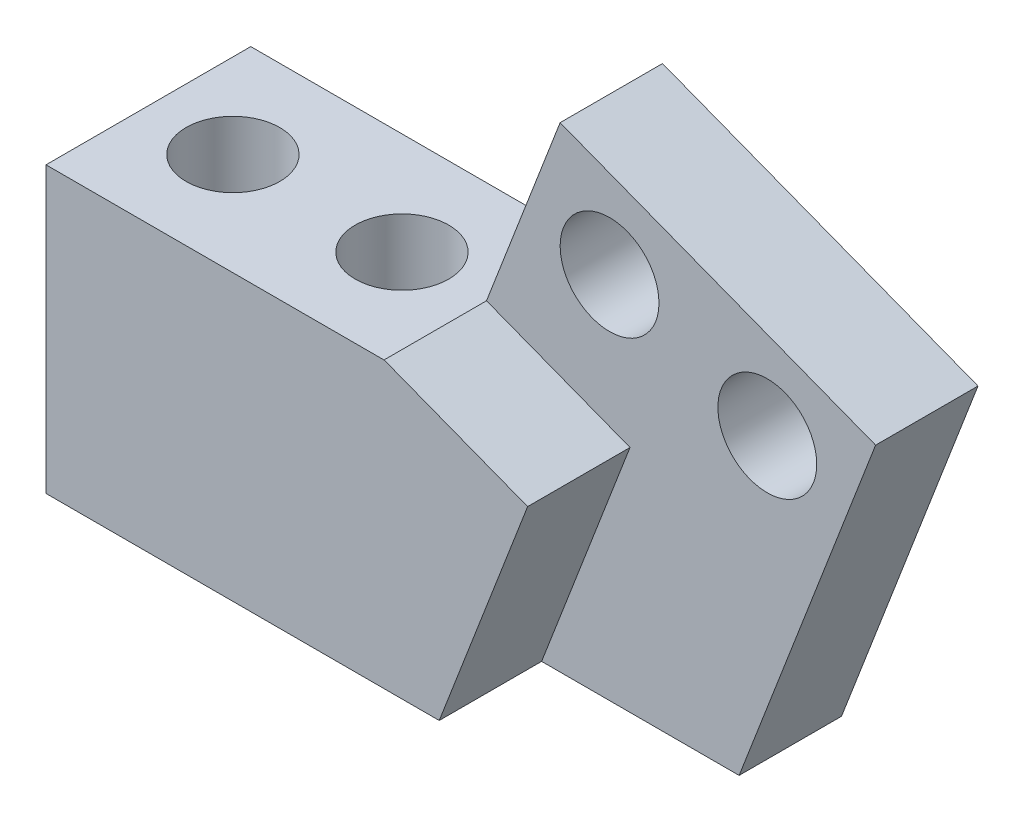
ISO-10303-21;
HEADER;
FILE_DESCRIPTION(('STEP AP214'),'2;1');
FILE_NAME('part.step','',(''),(''),'','','');
FILE_SCHEMA(('AUTOMOTIVE_DESIGN { 1 0 10303 214 1 1 1 1 }'));
ENDSEC;
DATA;
#1=APPLICATION_CONTEXT('core data for automotive mechanical design processes');
#2=APPLICATION_PROTOCOL_DEFINITION('international standard','automotive_design',2000,#1);
#3=PRODUCT_CONTEXT('',#1,'mechanical');
#4=PRODUCT('Part','Part','',(#3));
#5=PRODUCT_RELATED_PRODUCT_CATEGORY('part','',(#4));
#6=PRODUCT_DEFINITION_FORMATION('','',#4);
#7=PRODUCT_DEFINITION_CONTEXT('part definition',#1,'design');
#8=PRODUCT_DEFINITION('design','',#6,#7);
#9=PRODUCT_DEFINITION_SHAPE('','',#8);
#10=(LENGTH_UNIT() NAMED_UNIT(*) SI_UNIT(.MILLI.,.METRE.));
#11=(NAMED_UNIT(*) PLANE_ANGLE_UNIT() SI_UNIT($,.RADIAN.));
#12=(NAMED_UNIT(*) SI_UNIT($,.STERADIAN.) SOLID_ANGLE_UNIT());
#13=UNCERTAINTY_MEASURE_WITH_UNIT(LENGTH_MEASURE(1.E-05),#10,'distance_accuracy_value','');
#14=(GEOMETRIC_REPRESENTATION_CONTEXT(3) GLOBAL_UNCERTAINTY_ASSIGNED_CONTEXT((#13)) GLOBAL_UNIT_ASSIGNED_CONTEXT((#10,
#11,#12)) REPRESENTATION_CONTEXT('',''));
#15=CARTESIAN_POINT('',(0.,0.,0.));
#16=DIRECTION('',(0.,0.,1.));
#17=DIRECTION('',(1.,0.,0.));
#18=AXIS2_PLACEMENT_3D('',#15,#16,#17);
#19=CARTESIAN_POINT('',(-7.70308639124909,2.96774073142402,5.00000000000001));
#20=DIRECTION('',(0.933141900817577,-0.359508265466265,0.));
#21=DIRECTION('',(0.359508265466265,0.933141900817576,0.));
#22=AXIS2_PLACEMENT_3D('',#19,#20,#21);
#23=PLANE('',#22);
#24=DIRECTION('',(-0.359508265466265,-0.933141900817576,0.));
#25=VECTOR('',#24,1.);
#26=CARTESIAN_POINT('',(-7.70308639124909,2.96774073142402,5.00000000000001));
#27=LINE('',#26,#25);
#28=CARTESIAN_POINT('',(-11.2981690459117,-6.36367827675174,5.00000000000001));
#29=VERTEX_POINT('',#28);
#30=CARTESIAN_POINT('',(-11.3002079861797,-6.36897056285489,5.00000000000001));
#31=VERTEX_POINT('',#30);
#32=EDGE_CURVE('E151',#29,#31,#27,.T.);
#33=ORIENTED_EDGE('',*,*,#32,.F.);
#34=DIRECTION('',(0.,0.,1.));
#35=VECTOR('',#34,1.);
#36=CARTESIAN_POINT('',(-11.2981690459117,-6.36367827675174,0.));
#37=LINE('',#36,#35);
#38=CARTESIAN_POINT('',(-11.2981690459117,-6.36367827675174,0.));
#39=VERTEX_POINT('',#38);
#40=EDGE_CURVE('E43',#39,#29,#37,.T.);
#41=ORIENTED_EDGE('',*,*,#40,.F.);
#42=DIRECTION('',(-0.359508265466264,-0.933141900817576,0.));
#43=VECTOR('',#42,1.);
#44=CARTESIAN_POINT('',(-7.70308639124909,2.96774073142402,0.));
#45=LINE('',#44,#43);
#46=CARTESIAN_POINT('',(-7.70308639124909,2.96774073142402,0.));
#47=VERTEX_POINT('',#46);
#48=EDGE_CURVE('E118',#47,#39,#45,.T.);
#49=ORIENTED_EDGE('',*,*,#48,.F.);
#50=DIRECTION('',(0.,0.,-1.));
#51=VECTOR('',#50,1.);
#52=CARTESIAN_POINT('',(-7.70308639124909,2.96774073142402,5.00000000000001));
#53=LINE('',#52,#51);
#54=CARTESIAN_POINT('',(-7.70308639124909,2.96774073142402,-5.00000000000001));
#55=VERTEX_POINT('',#54);
#56=EDGE_CURVE('E157',#47,#55,#53,.T.);
#57=ORIENTED_EDGE('',*,*,#56,.T.);
#58=DIRECTION('',(-0.359508265466265,-0.933141900817576,0.));
#59=VECTOR('',#58,1.);
#60=CARTESIAN_POINT('',(-7.70308639124909,2.96774073142402,-5.00000000000001));
#61=LINE('',#60,#59);
#62=CARTESIAN_POINT('',(-11.3002079861797,-6.36897056285489,-5.00000000000001));
#63=VERTEX_POINT('',#62);
#64=EDGE_CURVE('E133',#55,#63,#61,.T.);
#65=ORIENTED_EDGE('',*,*,#64,.T.);
#66=DIRECTION('',(0.,0.,-1.));
#67=VECTOR('',#66,1.);
#68=CARTESIAN_POINT('',(-11.3002079861797,-6.36897056285489,5.00000000000001));
#69=LINE('',#68,#67);
#70=EDGE_CURVE('E11',#31,#63,#69,.T.);
#71=ORIENTED_EDGE('',*,*,#70,.F.);
#72=EDGE_LOOP('',(#33,#41,#49,#57,#65,#71));
#73=FACE_BOUND('',#72,.T.);
#74=ADVANCED_FACE('F29',(#73),#23,.F.);
#75=CARTESIAN_POINT('',(-27.8102079861797,-6.36897056285489,5.00000000000001));
#76=DIRECTION('',(0.,-1.,0.));
#77=DIRECTION('',(0.,0.,-1.));
#78=AXIS2_PLACEMENT_3D('',#75,#76,#77);
#79=PLANE('',#78);
#80=CARTESIAN_POINT('',(-15.4277079861797,-6.36897056285489,0.));
#81=DIRECTION('',(0.,1.,0.));
#82=DIRECTION('',(1.,0.,0.));
#83=AXIS2_PLACEMENT_3D('',#80,#81,#82);
#84=CIRCLE('',#83,2.286);
#85=CARTESIAN_POINT('',(-13.1417079861797,-6.36897056285489,0.));
#86=VERTEX_POINT('',#85);
#87=EDGE_CURVE('E278',#86,#86,#84,.T.);
#88=ORIENTED_EDGE('',*,*,#87,.F.);
#89=EDGE_LOOP('',(#88));
#90=FACE_BOUND('',#89,.T.);
#91=CARTESIAN_POINT('',(-23.6827079861797,-6.36897056285489,0.));
#92=DIRECTION('',(0.,1.,0.));
#93=DIRECTION('',(-1.,0.,0.));
#94=AXIS2_PLACEMENT_3D('',#91,#92,#93);
#95=CIRCLE('',#94,2.286);
#96=CARTESIAN_POINT('',(-25.9687079861797,-6.36897056285489,0.));
#97=VERTEX_POINT('',#96);
#98=EDGE_CURVE('E229',#97,#97,#95,.T.);
#99=ORIENTED_EDGE('',*,*,#98,.F.);
#100=EDGE_LOOP('',(#99));
#101=FACE_BOUND('',#100,.T.);
#102=DIRECTION('',(-1.,0.,0.));
#103=VECTOR('',#102,1.);
#104=CARTESIAN_POINT('',(-27.8102079861797,-6.36897056285489,-5.00000000000001));
#105=LINE('',#104,#103);
#106=CARTESIAN_POINT('',(-27.8102079861797,-6.36897056285489,-5.00000000000001));
#107=VERTEX_POINT('',#106);
#108=EDGE_CURVE('E138',#63,#107,#105,.T.);
#109=ORIENTED_EDGE('',*,*,#108,.T.);
#110=DIRECTION('',(0.,0.,-1.));
#111=VECTOR('',#110,1.);
#112=CARTESIAN_POINT('',(-27.8102079861797,-6.36897056285489,5.00000000000001));
#113=LINE('',#112,#111);
#114=CARTESIAN_POINT('',(-27.8102079861797,-6.36897056285489,5.00000000000001));
#115=VERTEX_POINT('',#114);
#116=EDGE_CURVE('E36',#115,#107,#113,.T.);
#117=ORIENTED_EDGE('',*,*,#116,.F.);
#118=DIRECTION('',(-1.,0.,0.));
#119=VECTOR('',#118,1.);
#120=CARTESIAN_POINT('',(-27.8102079861797,-6.36897056285489,5.00000000000001));
#121=LINE('',#120,#119);
#122=EDGE_CURVE('E153',#31,#115,#121,.T.);
#123=ORIENTED_EDGE('',*,*,#122,.F.);
#124=ORIENTED_EDGE('',*,*,#70,.T.);
#125=EDGE_LOOP('',(#109,#117,#123,#124));
#126=FACE_BOUND('',#125,.T.);
#127=ADVANCED_FACE('F190',(#90,#101,#126),#79,.F.);
#128=CARTESIAN_POINT('',(-27.8102079861797,-6.36897056285489,5.00000000000001));
#129=DIRECTION('',(1.,0.,0.));
#130=DIRECTION('',(0.,0.,-1.));
#131=AXIS2_PLACEMENT_3D('',#128,#129,#130);
#132=PLANE('',#131);
#133=DIRECTION('',(0.,-1.,0.));
#134=VECTOR('',#133,1.);
#135=CARTESIAN_POINT('',(-27.8102079861797,-6.36897056285489,-5.00000000000001));
#136=LINE('',#135,#134);
#137=CARTESIAN_POINT('',(-27.8102079861797,-20.2689705628549,-5.00000000000001));
#138=VERTEX_POINT('',#137);
#139=EDGE_CURVE('E140',#107,#138,#136,.T.);
#140=ORIENTED_EDGE('',*,*,#139,.T.);
#141=DIRECTION('',(0.,0.,-1.));
#142=VECTOR('',#141,1.);
#143=CARTESIAN_POINT('',(-27.8102079861797,-20.2689705628549,5.00000000000001));
#144=LINE('',#143,#142);
#145=CARTESIAN_POINT('',(-27.8102079861797,-20.2689705628549,5.00000000000001));
#146=VERTEX_POINT('',#145);
#147=EDGE_CURVE('E163',#146,#138,#144,.T.);
#148=ORIENTED_EDGE('',*,*,#147,.F.);
#149=DIRECTION('',(0.,-1.,0.));
#150=VECTOR('',#149,1.);
#151=CARTESIAN_POINT('',(-27.8102079861797,-6.36897056285489,5.00000000000001));
#152=LINE('',#151,#150);
#153=EDGE_CURVE('E51',#115,#146,#152,.T.);
#154=ORIENTED_EDGE('',*,*,#153,.F.);
#155=ORIENTED_EDGE('',*,*,#116,.T.);
#156=EDGE_LOOP('',(#140,#148,#154,#155));
#157=FACE_BOUND('',#156,.T.);
#158=ADVANCED_FACE('F169',(#157),#132,.F.);
#159=CARTESIAN_POINT('',(-27.8102079861797,-20.2689705628549,5.00000000000001));
#160=DIRECTION('',(0.,1.,0.));
#161=DIRECTION('',(0.,0.,1.));
#162=AXIS2_PLACEMENT_3D('',#159,#160,#161);
#163=PLANE('',#162);
#164=CARTESIAN_POINT('',(-15.4277079861797,-20.2689705628549,0.));
#165=DIRECTION('',(0.,1.,0.));
#166=DIRECTION('',(0.,0.,1.));
#167=AXIS2_PLACEMENT_3D('',#164,#165,#166);
#168=CIRCLE('',#167,2.286);
#169=CARTESIAN_POINT('',(-15.4277079861797,-20.2689705628549,2.286));
#170=VERTEX_POINT('',#169);
#171=EDGE_CURVE('E223',#170,#170,#168,.F.);
#172=ORIENTED_EDGE('',*,*,#171,.F.);
#173=EDGE_LOOP('',(#172));
#174=FACE_BOUND('',#173,.T.);
#175=CARTESIAN_POINT('',(-23.6827079861798,-20.2689705628549,0.));
#176=DIRECTION('',(0.,1.,0.));
#177=DIRECTION('',(0.,0.,1.));
#178=AXIS2_PLACEMENT_3D('',#175,#176,#177);
#179=CIRCLE('',#178,2.286);
#180=CARTESIAN_POINT('',(-23.6827079861798,-20.2689705628549,2.286));
#181=VERTEX_POINT('',#180);
#182=EDGE_CURVE('E226',#181,#181,#179,.F.);
#183=ORIENTED_EDGE('',*,*,#182,.F.);
#184=EDGE_LOOP('',(#183));
#185=FACE_BOUND('',#184,.T.);
#186=DIRECTION('',(1.,0.,0.));
#187=VECTOR('',#186,1.);
#188=CARTESIAN_POINT('',(-8.6073323283432,-20.2689705628549,0.));
#189=LINE('',#188,#187);
#190=CARTESIAN_POINT('',(-8.6073323283432,-20.2689705628549,0.));
#191=VERTEX_POINT('',#190);
#192=CARTESIAN_POINT('',(1.03750303068914,-20.2689705628549,0.));
#193=VERTEX_POINT('',#192);
#194=EDGE_CURVE('E127',#191,#193,#189,.T.);
#195=ORIENTED_EDGE('',*,*,#194,.F.);
#196=DIRECTION('',(0.,0.,1.));
#197=VECTOR('',#196,1.);
#198=CARTESIAN_POINT('',(-8.6073323283432,-20.2689705628549,0.));
#199=LINE('',#198,#197);
#200=CARTESIAN_POINT('',(-8.6073323283432,-20.2689705628549,5.00000000000001));
#201=VERTEX_POINT('',#200);
#202=EDGE_CURVE('E108',#191,#201,#199,.T.);
#203=ORIENTED_EDGE('',*,*,#202,.T.);
#204=DIRECTION('',(1.,0.,0.));
#205=VECTOR('',#204,1.);
#206=CARTESIAN_POINT('',(-27.8102079861797,-20.2689705628549,5.00000000000001));
#207=LINE('',#206,#205);
#208=EDGE_CURVE('E117',#146,#201,#207,.T.);
#209=ORIENTED_EDGE('',*,*,#208,.F.);
#210=ORIENTED_EDGE('',*,*,#147,.T.);
#211=DIRECTION('',(1.,0.,0.));
#212=VECTOR('',#211,1.);
#213=CARTESIAN_POINT('',(-27.8102079861797,-20.2689705628549,-5.00000000000001));
#214=LINE('',#213,#212);
#215=CARTESIAN_POINT('',(1.03750303068914,-20.2689705628549,-5.00000000000001));
#216=VERTEX_POINT('',#215);
#217=EDGE_CURVE('E142',#138,#216,#214,.T.);
#218=ORIENTED_EDGE('',*,*,#217,.T.);
#219=DIRECTION('',(0.,0.,-1.));
#220=VECTOR('',#219,1.);
#221=CARTESIAN_POINT('',(1.03750303068914,-20.2689705628549,5.00000000000001));
#222=LINE('',#221,#220);
#223=EDGE_CURVE('E161',#193,#216,#222,.T.);
#224=ORIENTED_EDGE('',*,*,#223,.F.);
#225=EDGE_LOOP('',(#195,#203,#209,#210,#218,#224));
#226=FACE_BOUND('',#225,.T.);
#227=ADVANCED_FACE('F181',(#174,#185,#226),#163,.F.);
#228=CARTESIAN_POINT('',(7.70308639124918,-2.96774073142401,5.00000000000001));
#229=DIRECTION('',(-0.933141900817577,0.359508265466264,0.));
#230=DIRECTION('',(-0.359508265466265,-0.933141900817576,0.));
#231=AXIS2_PLACEMENT_3D('',#228,#229,#230);
#232=PLANE('',#231);
#233=DIRECTION('',(0.,0.,-1.));
#234=VECTOR('',#233,1.);
#235=CARTESIAN_POINT('',(7.70308639124918,-2.96774073142401,5.00000000000001));
#236=LINE('',#235,#234);
#237=CARTESIAN_POINT('',(7.70308639124918,-2.96774073142401,0.));
#238=VERTEX_POINT('',#237);
#239=CARTESIAN_POINT('',(7.70308639124918,-2.96774073142401,-5.00000000000001));
#240=VERTEX_POINT('',#239);
#241=EDGE_CURVE('E159',#238,#240,#236,.T.);
#242=ORIENTED_EDGE('',*,*,#241,.F.);
#243=DIRECTION('',(0.359508265466265,0.933141900817576,0.));
#244=VECTOR('',#243,1.);
#245=CARTESIAN_POINT('',(7.70308639124918,-2.96774073142401,0.));
#246=LINE('',#245,#244);
#247=EDGE_CURVE('E129',#193,#238,#246,.T.);
#248=ORIENTED_EDGE('',*,*,#247,.F.);
#249=ORIENTED_EDGE('',*,*,#223,.T.);
#250=DIRECTION('',(0.359508265466265,0.933141900817576,0.));
#251=VECTOR('',#250,1.);
#252=CARTESIAN_POINT('',(7.70308639124918,-2.96774073142401,-5.00000000000001));
#253=LINE('',#252,#251);
#254=EDGE_CURVE('E145',#216,#240,#253,.T.);
#255=ORIENTED_EDGE('',*,*,#254,.T.);
#256=EDGE_LOOP('',(#242,#248,#249,#255));
#257=FACE_BOUND('',#256,.T.);
#258=ADVANCED_FACE('F194',(#257),#232,.F.);
#259=CARTESIAN_POINT('',(-7.70308639124909,2.96774073142402,5.00000000000001));
#260=DIRECTION('',(-0.359508265466265,-0.933141900817575,0.));
#261=DIRECTION('',(0.933141900817577,-0.359508265466265,0.));
#262=AXIS2_PLACEMENT_3D('',#259,#260,#261);
#263=PLANE('',#262);
#264=ORIENTED_EDGE('',*,*,#56,.F.);
#265=DIRECTION('',(-0.933141900817577,0.359508265466264,0.));
#266=VECTOR('',#265,1.);
#267=CARTESIAN_POINT('',(-7.70308639124909,2.96774073142402,0.));
#268=LINE('',#267,#266);
#269=EDGE_CURVE('E131',#238,#47,#268,.T.);
#270=ORIENTED_EDGE('',*,*,#269,.F.);
#271=ORIENTED_EDGE('',*,*,#241,.T.);
#272=DIRECTION('',(-0.933141900817577,0.359508265466265,0.));
#273=VECTOR('',#272,1.);
#274=CARTESIAN_POINT('',(-7.70308639124909,2.96774073142402,-5.00000000000001));
#275=LINE('',#274,#273);
#276=EDGE_CURVE('E148',#240,#55,#275,.T.);
#277=ORIENTED_EDGE('',*,*,#276,.T.);
#278=EDGE_LOOP('',(#264,#270,#271,#277));
#279=FACE_BOUND('',#278,.T.);
#280=ADVANCED_FACE('F195',(#279),#263,.F.);
#281=CARTESIAN_POINT('',(-7.70308639124909,2.96774073142401,5.00000000000001));
#282=DIRECTION('',(0.,0.,1.));
#283=DIRECTION('',(1.,0.,0.));
#284=AXIS2_PLACEMENT_3D('',#281,#282,#283);
#285=PLANE('',#284);
#286=DIRECTION('',(-0.359508265466265,-0.933141900817576,0.));
#287=VECTOR('',#286,1.);
#288=CARTESIAN_POINT('',(-8.6073323283432,-20.2689705628549,5.00000000000001));
#289=LINE('',#288,#287);
#290=CARTESIAN_POINT('',(-4.29027337077174,-9.06358535040339,5.00000000000001));
#291=VERTEX_POINT('',#290);
#292=EDGE_CURVE('E103',#291,#201,#289,.T.);
#293=ORIENTED_EDGE('',*,*,#292,.F.);
#294=DIRECTION('',(0.933141900817577,-0.359508265466264,0.));
#295=VECTOR('',#294,1.);
#296=CARTESIAN_POINT('',(-4.29027337077174,-9.06358535040339,5.00000000000001));
#297=LINE('',#296,#295);
#298=EDGE_CURVE('E110',#29,#291,#297,.T.);
#299=ORIENTED_EDGE('',*,*,#298,.F.);
#300=ORIENTED_EDGE('',*,*,#32,.T.);
#301=ORIENTED_EDGE('',*,*,#122,.T.);
#302=ORIENTED_EDGE('',*,*,#153,.T.);
#303=ORIENTED_EDGE('',*,*,#208,.T.);
#304=EDGE_LOOP('',(#293,#299,#300,#301,#302,#303));
#305=FACE_BOUND('',#304,.T.);
#306=ADVANCED_FACE('F115',(#305),#285,.T.);
#307=CARTESIAN_POINT('',(-7.70308639124909,2.96774073142401,-5.00000000000001));
#308=DIRECTION('',(0.,0.,1.));
#309=DIRECTION('',(1.,0.,0.));
#310=AXIS2_PLACEMENT_3D('',#307,#308,#309);
#311=PLANE('',#310);
#312=CARTESIAN_POINT('',(-5.28957625748951,-2.24869723755831,-5.00000000000001));
#313=DIRECTION('',(0.,0.,1.));
#314=DIRECTION('',(1.,0.,0.));
#315=AXIS2_PLACEMENT_3D('',#312,#313,#314);
#316=CIRCLE('',#315,2.413);
#317=CARTESIAN_POINT('',(-2.8765762574895,-2.24869723755831,-5.00000000000001));
#318=VERTEX_POINT('',#317);
#319=EDGE_CURVE('E232',#318,#318,#316,.F.);
#320=ORIENTED_EDGE('',*,*,#319,.F.);
#321=EDGE_LOOP('',(#320));
#322=FACE_BOUND('',#321,.T.);
#323=CARTESIAN_POINT('',(2.41351013375958,-5.21643796898231,-5.00000000000001));
#324=DIRECTION('',(0.,0.,1.));
#325=DIRECTION('',(1.,0.,0.));
#326=AXIS2_PLACEMENT_3D('',#323,#324,#325);
#327=CIRCLE('',#326,2.413);
#328=CARTESIAN_POINT('',(4.82651013375958,-5.21643796898231,-5.00000000000001));
#329=VERTEX_POINT('',#328);
#330=EDGE_CURVE('E113',#329,#329,#327,.F.);
#331=ORIENTED_EDGE('',*,*,#330,.F.);
#332=EDGE_LOOP('',(#331));
#333=FACE_BOUND('',#332,.T.);
#334=ORIENTED_EDGE('',*,*,#64,.F.);
#335=ORIENTED_EDGE('',*,*,#276,.F.);
#336=ORIENTED_EDGE('',*,*,#254,.F.);
#337=ORIENTED_EDGE('',*,*,#217,.F.);
#338=ORIENTED_EDGE('',*,*,#139,.F.);
#339=ORIENTED_EDGE('',*,*,#108,.F.);
#340=EDGE_LOOP('',(#334,#335,#336,#337,#338,#339));
#341=FACE_BOUND('',#340,.T.);
#342=ADVANCED_FACE('F175',(#322,#333,#341),#311,.F.);
#343=CARTESIAN_POINT('',(-8.6073323283432,-20.2689705628549,0.));
#344=DIRECTION('',(-0.933141900817577,0.359508265466264,0.));
#345=DIRECTION('',(-0.359508265466265,-0.933141900817576,0.));
#346=AXIS2_PLACEMENT_3D('',#343,#344,#345);
#347=PLANE('',#346);
#348=ORIENTED_EDGE('',*,*,#292,.T.);
#349=ORIENTED_EDGE('',*,*,#202,.F.);
#350=DIRECTION('',(-0.359508265466265,-0.933141900817576,0.));
#351=VECTOR('',#350,1.);
#352=CARTESIAN_POINT('',(-8.6073323283432,-20.2689705628549,0.));
#353=LINE('',#352,#351);
#354=CARTESIAN_POINT('',(-4.29027337077174,-9.06358535040339,0.));
#355=VERTEX_POINT('',#354);
#356=EDGE_CURVE('E106',#355,#191,#353,.T.);
#357=ORIENTED_EDGE('',*,*,#356,.F.);
#358=DIRECTION('',(0.,0.,1.));
#359=VECTOR('',#358,1.);
#360=CARTESIAN_POINT('',(-4.29027337077174,-9.06358535040339,0.));
#361=LINE('',#360,#359);
#362=EDGE_CURVE('E100',#355,#291,#361,.T.);
#363=ORIENTED_EDGE('',*,*,#362,.T.);
#364=EDGE_LOOP('',(#348,#349,#357,#363));
#365=FACE_BOUND('',#364,.T.);
#366=ADVANCED_FACE('F101',(#365),#347,.F.);
#367=CARTESIAN_POINT('',(-4.29027337077174,-9.06358535040339,0.));
#368=DIRECTION('',(-0.359508265466265,-0.933141900817576,0.));
#369=DIRECTION('',(0.933141900817577,-0.359508265466264,0.));
#370=AXIS2_PLACEMENT_3D('',#367,#368,#369);
#371=PLANE('',#370);
#372=ORIENTED_EDGE('',*,*,#298,.T.);
#373=ORIENTED_EDGE('',*,*,#362,.F.);
#374=DIRECTION('',(0.933141900817577,-0.359508265466264,0.));
#375=VECTOR('',#374,1.);
#376=CARTESIAN_POINT('',(-4.29027337077174,-9.06358535040339,0.));
#377=LINE('',#376,#375);
#378=EDGE_CURVE('E121',#39,#355,#377,.T.);
#379=ORIENTED_EDGE('',*,*,#378,.F.);
#380=ORIENTED_EDGE('',*,*,#40,.T.);
#381=EDGE_LOOP('',(#372,#373,#379,#380));
#382=FACE_BOUND('',#381,.T.);
#383=ADVANCED_FACE('F111',(#382),#371,.F.);
#384=CARTESIAN_POINT('',(-11.2981690459117,-6.36367827675174,0.));
#385=DIRECTION('',(0.,0.,-1.));
#386=DIRECTION('',(-1.,0.,0.));
#387=AXIS2_PLACEMENT_3D('',#384,#385,#386);
#388=PLANE('',#387);
#389=CARTESIAN_POINT('',(-5.28957625748951,-2.24869723755831,0.));
#390=DIRECTION('',(0.,0.,1.));
#391=DIRECTION('',(-1.,0.,0.));
#392=AXIS2_PLACEMENT_3D('',#389,#390,#391);
#393=CIRCLE('',#392,2.413);
#394=CARTESIAN_POINT('',(-7.70257625748951,-2.24869723755831,0.));
#395=VERTEX_POINT('',#394);
#396=EDGE_CURVE('E228',#395,#395,#393,.T.);
#397=ORIENTED_EDGE('',*,*,#396,.F.);
#398=EDGE_LOOP('',(#397));
#399=FACE_BOUND('',#398,.T.);
#400=CARTESIAN_POINT('',(2.4135101337595,-5.21643796898231,0.));
#401=DIRECTION('',(0.,0.,1.));
#402=DIRECTION('',(1.,0.,0.));
#403=AXIS2_PLACEMENT_3D('',#400,#401,#402);
#404=CIRCLE('',#403,2.413);
#405=CARTESIAN_POINT('',(4.8265101337595,-5.21643796898231,0.));
#406=VERTEX_POINT('',#405);
#407=EDGE_CURVE('E240',#406,#406,#404,.T.);
#408=ORIENTED_EDGE('',*,*,#407,.F.);
#409=EDGE_LOOP('',(#408));
#410=FACE_BOUND('',#409,.T.);
#411=ORIENTED_EDGE('',*,*,#48,.T.);
#412=ORIENTED_EDGE('',*,*,#378,.T.);
#413=ORIENTED_EDGE('',*,*,#356,.T.);
#414=ORIENTED_EDGE('',*,*,#194,.T.);
#415=ORIENTED_EDGE('',*,*,#247,.T.);
#416=ORIENTED_EDGE('',*,*,#269,.T.);
#417=EDGE_LOOP('',(#411,#412,#413,#414,#415,#416));
#418=FACE_BOUND('',#417,.T.);
#419=ADVANCED_FACE('F183',(#399,#410,#418),#388,.F.);
#420=CARTESIAN_POINT('',(2.41351013375958,-5.21643796898231,-11.8249946520126));
#421=DIRECTION('',(0.,0.,1.));
#422=DIRECTION('',(1.,0.,0.));
#423=AXIS2_PLACEMENT_3D('',#420,#421,#422);
#424=CYLINDRICAL_SURFACE('',#423,2.413);
#425=ORIENTED_EDGE('',*,*,#330,.T.);
#426=EDGE_LOOP('',(#425));
#427=FACE_BOUND('',#426,.T.);
#428=ORIENTED_EDGE('',*,*,#407,.T.);
#429=EDGE_LOOP('',(#428));
#430=FACE_BOUND('',#429,.T.);
#431=ADVANCED_FACE('F245',(#427,#430),#424,.F.);
#432=CARTESIAN_POINT('',(-5.28957625748951,-2.24869723755831,-11.8249946520126));
#433=DIRECTION('',(0.,0.,1.));
#434=DIRECTION('',(1.,0.,0.));
#435=AXIS2_PLACEMENT_3D('',#432,#433,#434);
#436=CYLINDRICAL_SURFACE('',#435,2.413);
#437=ORIENTED_EDGE('',*,*,#319,.T.);
#438=EDGE_LOOP('',(#437));
#439=FACE_BOUND('',#438,.T.);
#440=ORIENTED_EDGE('',*,*,#396,.T.);
#441=EDGE_LOOP('',(#440));
#442=FACE_BOUND('',#441,.T.);
#443=ADVANCED_FACE('F264',(#439,#442),#436,.F.);
#444=CARTESIAN_POINT('',(-23.6827079861797,-26.7347549700247,0.));
#445=DIRECTION('',(0.,1.,0.));
#446=DIRECTION('',(-1.,0.,0.));
#447=AXIS2_PLACEMENT_3D('',#444,#445,#446);
#448=CYLINDRICAL_SURFACE('',#447,2.286);
#449=ORIENTED_EDGE('',*,*,#182,.T.);
#450=EDGE_LOOP('',(#449));
#451=FACE_BOUND('',#450,.T.);
#452=ORIENTED_EDGE('',*,*,#98,.T.);
#453=EDGE_LOOP('',(#452));
#454=FACE_BOUND('',#453,.T.);
#455=ADVANCED_FACE('F267',(#451,#454),#448,.F.);
#456=CARTESIAN_POINT('',(-15.4277079861797,-26.7347549700247,0.));
#457=DIRECTION('',(0.,1.,0.));
#458=DIRECTION('',(-1.,0.,0.));
#459=AXIS2_PLACEMENT_3D('',#456,#457,#458);
#460=CYLINDRICAL_SURFACE('',#459,2.286);
#461=ORIENTED_EDGE('',*,*,#171,.T.);
#462=EDGE_LOOP('',(#461));
#463=FACE_BOUND('',#462,.T.);
#464=ORIENTED_EDGE('',*,*,#87,.T.);
#465=EDGE_LOOP('',(#464));
#466=FACE_BOUND('',#465,.T.);
#467=ADVANCED_FACE('F271',(#463,#466),#460,.F.);
#468=CLOSED_SHELL('',(#74,#127,#158,#227,#258,#280,#306,#342,#366,#383,#419,#431,#443,#455,#467));
#469=MANIFOLD_SOLID_BREP('B2',#468);
#470=ADVANCED_BREP_SHAPE_REPRESENTATION('',(#18,#469),#14);
#471=SHAPE_DEFINITION_REPRESENTATION(#9,#470);
ENDSEC;
END-ISO-10303-21;
